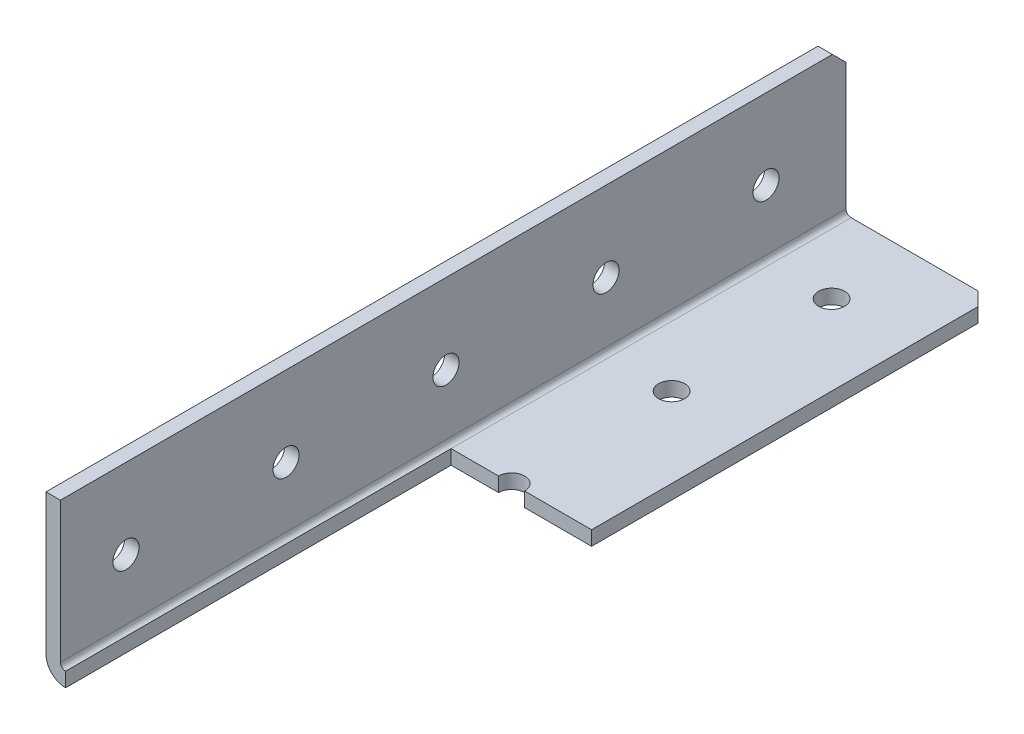
ISO-10303-21;
HEADER;
FILE_DESCRIPTION(('STEP AP214'),'2;1');
FILE_NAME('part.step','',(''),(''),'','','');
FILE_SCHEMA(('AUTOMOTIVE_DESIGN { 1 0 10303 214 1 1 1 1 }'));
ENDSEC;
DATA;
#1=APPLICATION_CONTEXT('core data for automotive mechanical design processes');
#2=APPLICATION_PROTOCOL_DEFINITION('international standard','automotive_design',2000,#1);
#3=PRODUCT_CONTEXT('',#1,'mechanical');
#4=PRODUCT('Part','Part','',(#3));
#5=PRODUCT_RELATED_PRODUCT_CATEGORY('part','',(#4));
#6=PRODUCT_DEFINITION_FORMATION('','',#4);
#7=PRODUCT_DEFINITION_CONTEXT('part definition',#1,'design');
#8=PRODUCT_DEFINITION('design','',#6,#7);
#9=PRODUCT_DEFINITION_SHAPE('','',#8);
#10=(LENGTH_UNIT() NAMED_UNIT(*) SI_UNIT(.MILLI.,.METRE.));
#11=(NAMED_UNIT(*) PLANE_ANGLE_UNIT() SI_UNIT($,.RADIAN.));
#12=(NAMED_UNIT(*) SI_UNIT($,.STERADIAN.) SOLID_ANGLE_UNIT());
#13=UNCERTAINTY_MEASURE_WITH_UNIT(LENGTH_MEASURE(1.E-05),#10,'distance_accuracy_value','');
#14=(GEOMETRIC_REPRESENTATION_CONTEXT(3) GLOBAL_UNCERTAINTY_ASSIGNED_CONTEXT((#13)) GLOBAL_UNIT_ASSIGNED_CONTEXT((#10,
#11,#12)) REPRESENTATION_CONTEXT('',''));
#15=CARTESIAN_POINT('',(0.,0.,0.));
#16=DIRECTION('',(0.,0.,1.));
#17=DIRECTION('',(1.,0.,0.));
#18=AXIS2_PLACEMENT_3D('',#15,#16,#17);
#19=CARTESIAN_POINT('',(25.4,0.,-749.3));
#20=DIRECTION('',(0.,-1.,0.));
#21=DIRECTION('',(0.,0.,-1.));
#22=AXIS2_PLACEMENT_3D('',#19,#20,#21);
#23=PLANE('',#22);
#24=DIRECTION('',(1.,0.,0.));
#25=VECTOR('',#24,1.);
#26=CARTESIAN_POINT('',(25.4,0.,-685.8));
#27=LINE('',#26,#25);
#28=CARTESIAN_POINT('',(3.0988,0.,-685.8));
#29=VERTEX_POINT('',#28);
#30=CARTESIAN_POINT('',(10.6299000000001,0.,-685.8));
#31=VERTEX_POINT('',#30);
#32=EDGE_CURVE('E221',#29,#31,#27,.T.);
#33=ORIENTED_EDGE('',*,*,#32,.F.);
#34=DIRECTION('',(0.,0.,1.));
#35=VECTOR('',#34,1.);
#36=CARTESIAN_POINT('',(3.0988,0.,-749.3));
#37=LINE('',#36,#35);
#38=CARTESIAN_POINT('',(3.0988,0.,-749.3));
#39=VERTEX_POINT('',#38);
#40=EDGE_CURVE('E203',#29,#39,#37,.F.);
#41=ORIENTED_EDGE('',*,*,#40,.T.);
#42=DIRECTION('',(-1.,0.,0.));
#43=VECTOR('',#42,1.);
#44=CARTESIAN_POINT('',(25.4,0.,-749.3));
#45=LINE('',#44,#43);
#46=CARTESIAN_POINT('',(23.2409999999998,0.,-749.3));
#47=VERTEX_POINT('',#46);
#48=EDGE_CURVE('E163',#47,#39,#45,.T.);
#49=ORIENTED_EDGE('',*,*,#48,.F.);
#50=DIRECTION('',(0.707106781186584,0.,0.707106781186511));
#51=VECTOR('',#50,1.);
#52=CARTESIAN_POINT('',(24.3205,0.,-748.2205));
#53=LINE('',#52,#51);
#54=CARTESIAN_POINT('',(25.4,0.,-747.141));
#55=VERTEX_POINT('',#54);
#56=EDGE_CURVE('E181',#47,#55,#53,.T.);
#57=ORIENTED_EDGE('',*,*,#56,.T.);
#58=DIRECTION('',(0.,0.,1.));
#59=VECTOR('',#58,1.);
#60=CARTESIAN_POINT('',(25.4,0.,-749.3));
#61=LINE('',#60,#59);
#62=CARTESIAN_POINT('',(25.4,0.,-685.8));
#63=VERTEX_POINT('',#62);
#64=EDGE_CURVE('E161',#55,#63,#61,.T.);
#65=ORIENTED_EDGE('',*,*,#64,.T.);
#66=CARTESIAN_POINT('',(14.7701,0.,-685.8));
#67=VERTEX_POINT('',#66);
#68=EDGE_CURVE('E131',#67,#63,#27,.T.);
#69=ORIENTED_EDGE('',*,*,#68,.F.);
#70=CARTESIAN_POINT('',(12.7,0.,-685.8));
#71=DIRECTION('',(0.,-1.,0.));
#72=DIRECTION('',(0.,0.,-1.));
#73=AXIS2_PLACEMENT_3D('',#70,#71,#72);
#74=CIRCLE('',#73,2.07009999999995);
#75=EDGE_CURVE('E231',#31,#67,#74,.T.);
#76=ORIENTED_EDGE('',*,*,#75,.F.);
#77=EDGE_LOOP('',(#33,#41,#49,#57,#65,#69,#76));
#78=FACE_BOUND('',#77,.T.);
#79=CARTESIAN_POINT('',(12.7,0.,-736.6));
#80=DIRECTION('',(0.,-1.,0.));
#81=DIRECTION('',(0.,0.,-1.));
#82=AXIS2_PLACEMENT_3D('',#79,#80,#81);
#83=CIRCLE('',#82,2.07009999999995);
#84=CARTESIAN_POINT('',(12.7,0.,-738.6701));
#85=VERTEX_POINT('',#84);
#86=EDGE_CURVE('E175',#85,#85,#83,.T.);
#87=ORIENTED_EDGE('',*,*,#86,.F.);
#88=EDGE_LOOP('',(#87));
#89=FACE_BOUND('',#88,.T.);
#90=CARTESIAN_POINT('',(12.7,0.,-711.2));
#91=DIRECTION('',(0.,-1.,0.));
#92=DIRECTION('',(0.,0.,-1.));
#93=AXIS2_PLACEMENT_3D('',#90,#91,#92);
#94=CIRCLE('',#93,2.07009999999995);
#95=CARTESIAN_POINT('',(12.7,0.,-713.2701));
#96=VERTEX_POINT('',#95);
#97=EDGE_CURVE('E174',#96,#96,#94,.T.);
#98=ORIENTED_EDGE('',*,*,#97,.F.);
#99=EDGE_LOOP('',(#98));
#100=FACE_BOUND('',#99,.T.);
#101=ADVANCED_FACE('F34',(#78,#89,#100),#23,.T.);
#102=CARTESIAN_POINT('',(25.4,25.4,-749.3));
#103=DIRECTION('',(0.,0.,-1.));
#104=DIRECTION('',(-1.,0.,0.));
#105=AXIS2_PLACEMENT_3D('',#102,#103,#104);
#106=PLANE('',#105);
#107=ORIENTED_EDGE('',*,*,#48,.T.);
#108=CARTESIAN_POINT('',(3.0988,3.0988,-749.3));
#109=DIRECTION('',(0.,0.,-1.));
#110=DIRECTION('',(-1.,0.,0.));
#111=AXIS2_PLACEMENT_3D('',#108,#109,#110);
#112=CIRCLE('',#111,3.0988);
#113=CARTESIAN_POINT('',(0.,3.0988,-749.3));
#114=VERTEX_POINT('',#113);
#115=EDGE_CURVE('E206',#39,#114,#112,.T.);
#116=ORIENTED_EDGE('',*,*,#115,.T.);
#117=DIRECTION('',(0.,-1.,0.));
#118=VECTOR('',#117,1.);
#119=CARTESIAN_POINT('',(0.,25.4,-749.3));
#120=LINE('',#119,#118);
#121=CARTESIAN_POINT('',(0.,23.241,-749.3));
#122=VERTEX_POINT('',#121);
#123=EDGE_CURVE('E164',#122,#114,#120,.T.);
#124=ORIENTED_EDGE('',*,*,#123,.F.);
#125=DIRECTION('',(1.,0.,0.));
#126=VECTOR('',#125,1.);
#127=CARTESIAN_POINT('',(25.4,23.241,-749.3));
#128=LINE('',#127,#126);
#129=CARTESIAN_POINT('',(2.286,23.241,-749.3));
#130=VERTEX_POINT('',#129);
#131=EDGE_CURVE('E170',#122,#130,#128,.T.);
#132=ORIENTED_EDGE('',*,*,#131,.T.);
#133=DIRECTION('',(0.,1.,0.));
#134=VECTOR('',#133,1.);
#135=CARTESIAN_POINT('',(2.286,2.286,-749.3));
#136=LINE('',#135,#134);
#137=CARTESIAN_POINT('',(2.286,3.0988,-749.3));
#138=VERTEX_POINT('',#137);
#139=EDGE_CURVE('E154',#138,#130,#136,.T.);
#140=ORIENTED_EDGE('',*,*,#139,.F.);
#141=CARTESIAN_POINT('',(3.0988,3.0988,-749.3));
#142=DIRECTION('',(0.,0.,-1.));
#143=DIRECTION('',(-1.,0.,0.));
#144=AXIS2_PLACEMENT_3D('',#141,#142,#143);
#145=CIRCLE('',#144,0.8128);
#146=CARTESIAN_POINT('',(3.0988,2.286,-749.3));
#147=VERTEX_POINT('',#146);
#148=EDGE_CURVE('E198',#138,#147,#145,.F.);
#149=ORIENTED_EDGE('',*,*,#148,.T.);
#150=DIRECTION('',(-1.,0.,0.));
#151=VECTOR('',#150,1.);
#152=CARTESIAN_POINT('',(25.4,2.286,-749.3));
#153=LINE('',#152,#151);
#154=CARTESIAN_POINT('',(23.2409999999998,2.286,-749.3));
#155=VERTEX_POINT('',#154);
#156=EDGE_CURVE('E158',#155,#147,#153,.T.);
#157=ORIENTED_EDGE('',*,*,#156,.F.);
#158=DIRECTION('',(0.,-1.,0.));
#159=VECTOR('',#158,1.);
#160=CARTESIAN_POINT('',(23.2409999999998,0.,-749.3));
#161=LINE('',#160,#159);
#162=EDGE_CURVE('E178',#155,#47,#161,.T.);
#163=ORIENTED_EDGE('',*,*,#162,.T.);
#164=EDGE_LOOP('',(#107,#116,#124,#132,#140,#149,#157,#163));
#165=FACE_BOUND('',#164,.T.);
#166=ADVANCED_FACE('F310',(#165),#106,.T.);
#167=CARTESIAN_POINT('',(25.4,25.4,749.3));
#168=DIRECTION('',(0.,1.,0.));
#169=DIRECTION('',(0.,0.,1.));
#170=AXIS2_PLACEMENT_3D('',#167,#168,#169);
#171=PLANE('',#170);
#172=DIRECTION('',(-1.,0.,0.));
#173=VECTOR('',#172,1.);
#174=CARTESIAN_POINT('',(25.4,25.4,-624.586));
#175=LINE('',#174,#173);
#176=CARTESIAN_POINT('',(2.286,25.4,-624.586));
#177=VERTEX_POINT('',#176);
#178=CARTESIAN_POINT('',(0.,25.4000000000002,-624.586));
#179=VERTEX_POINT('',#178);
#180=EDGE_CURVE('E236',#177,#179,#175,.T.);
#181=ORIENTED_EDGE('',*,*,#180,.F.);
#182=DIRECTION('',(0.,0.,-1.));
#183=VECTOR('',#182,1.);
#184=CARTESIAN_POINT('',(2.286,25.4,749.3));
#185=LINE('',#184,#183);
#186=CARTESIAN_POINT('',(2.286,25.4,-747.141));
#187=VERTEX_POINT('',#186);
#188=EDGE_CURVE('E153',#177,#187,#185,.T.);
#189=ORIENTED_EDGE('',*,*,#188,.T.);
#190=DIRECTION('',(-1.,0.,0.));
#191=VECTOR('',#190,1.);
#192=CARTESIAN_POINT('',(25.4,25.4,-747.141));
#193=LINE('',#192,#191);
#194=CARTESIAN_POINT('',(0.,25.4000000000002,-747.140999999999));
#195=VERTEX_POINT('',#194);
#196=EDGE_CURVE('E186',#187,#195,#193,.T.);
#197=ORIENTED_EDGE('',*,*,#196,.T.);
#198=DIRECTION('',(0.,0.,-1.));
#199=VECTOR('',#198,1.);
#200=CARTESIAN_POINT('',(0.,25.4,749.3));
#201=LINE('',#200,#199);
#202=EDGE_CURVE('E156',#179,#195,#201,.T.);
#203=ORIENTED_EDGE('',*,*,#202,.F.);
#204=EDGE_LOOP('',(#181,#189,#197,#203));
#205=FACE_BOUND('',#204,.T.);
#206=ADVANCED_FACE('F303',(#205),#171,.T.);
#207=CARTESIAN_POINT('',(25.4,0.,0.));
#208=DIRECTION('',(-1.,0.,0.));
#209=DIRECTION('',(0.,0.,1.));
#210=AXIS2_PLACEMENT_3D('',#207,#208,#209);
#211=PLANE('',#210);
#212=DIRECTION('',(0.,0.,-1.));
#213=VECTOR('',#212,1.);
#214=CARTESIAN_POINT('',(25.4,2.286,749.3));
#215=LINE('',#214,#213);
#216=CARTESIAN_POINT('',(25.4,2.286,-685.8));
#217=VERTEX_POINT('',#216);
#218=CARTESIAN_POINT('',(25.4000000000001,2.286,-747.141));
#219=VERTEX_POINT('',#218);
#220=EDGE_CURVE('E142',#217,#219,#215,.T.);
#221=ORIENTED_EDGE('',*,*,#220,.F.);
#222=DIRECTION('',(0.,1.,0.));
#223=VECTOR('',#222,1.);
#224=CARTESIAN_POINT('',(25.4,-0.254,-685.8));
#225=LINE('',#224,#223);
#226=EDGE_CURVE('E128',#63,#217,#225,.T.);
#227=ORIENTED_EDGE('',*,*,#226,.F.);
#228=ORIENTED_EDGE('',*,*,#64,.F.);
#229=DIRECTION('',(0.,1.,0.));
#230=VECTOR('',#229,1.);
#231=CARTESIAN_POINT('',(25.4,2.286,-747.141));
#232=LINE('',#231,#230);
#233=EDGE_CURVE('E151',#55,#219,#232,.T.);
#234=ORIENTED_EDGE('',*,*,#233,.T.);
#235=EDGE_LOOP('',(#221,#227,#228,#234));
#236=FACE_BOUND('',#235,.T.);
#237=ADVANCED_FACE('F149',(#236),#211,.F.);
#238=CARTESIAN_POINT('',(0.,0.,0.));
#239=DIRECTION('',(-1.,0.,0.));
#240=DIRECTION('',(0.,0.,1.));
#241=AXIS2_PLACEMENT_3D('',#238,#239,#240);
#242=PLANE('',#241);
#243=DIRECTION('',(0.,-1.,0.));
#244=VECTOR('',#243,1.);
#245=CARTESIAN_POINT('',(0.,0.,-624.586));
#246=LINE('',#245,#244);
#247=CARTESIAN_POINT('',(0.,3.0988,-624.586));
#248=VERTEX_POINT('',#247);
#249=EDGE_CURVE('E57',#179,#248,#246,.T.);
#250=ORIENTED_EDGE('',*,*,#249,.F.);
#251=ORIENTED_EDGE('',*,*,#202,.T.);
#252=DIRECTION('',(0.,0.707106781186511,0.707106781186584));
#253=VECTOR('',#252,1.);
#254=CARTESIAN_POINT('',(0.,386.270500000001,-386.270499999961));
#255=LINE('',#254,#253);
#256=EDGE_CURVE('E189',#195,#122,#255,.F.);
#257=ORIENTED_EDGE('',*,*,#256,.T.);
#258=ORIENTED_EDGE('',*,*,#123,.T.);
#259=DIRECTION('',(0.,0.,1.));
#260=VECTOR('',#259,1.);
#261=CARTESIAN_POINT('',(0.,3.0988,0.));
#262=LINE('',#261,#260);
#263=EDGE_CURVE('E200',#114,#248,#262,.T.);
#264=ORIENTED_EDGE('',*,*,#263,.T.);
#265=EDGE_LOOP('',(#250,#251,#257,#258,#264));
#266=FACE_BOUND('',#265,.T.);
#267=CARTESIAN_POINT('',(0.,12.7,-635.));
#268=DIRECTION('',(-1.,0.,0.));
#269=DIRECTION('',(0.,0.,1.));
#270=AXIS2_PLACEMENT_3D('',#267,#268,#269);
#271=CIRCLE('',#270,2.07009999999995);
#272=CARTESIAN_POINT('',(0.,12.7,-632.9299));
#273=VERTEX_POINT('',#272);
#274=EDGE_CURVE('E245',#273,#273,#271,.T.);
#275=ORIENTED_EDGE('',*,*,#274,.F.);
#276=EDGE_LOOP('',(#275));
#277=FACE_BOUND('',#276,.T.);
#278=CARTESIAN_POINT('',(0.,12.7,-660.4));
#279=DIRECTION('',(-1.,0.,0.));
#280=DIRECTION('',(0.,0.,1.));
#281=AXIS2_PLACEMENT_3D('',#278,#279,#280);
#282=CIRCLE('',#281,2.07009999999995);
#283=CARTESIAN_POINT('',(0.,12.7,-658.3299));
#284=VERTEX_POINT('',#283);
#285=EDGE_CURVE('E251',#284,#284,#282,.T.);
#286=ORIENTED_EDGE('',*,*,#285,.F.);
#287=EDGE_LOOP('',(#286));
#288=FACE_BOUND('',#287,.T.);
#289=CARTESIAN_POINT('',(0.,12.7,-685.8));
#290=DIRECTION('',(-1.,0.,0.));
#291=DIRECTION('',(0.,0.,1.));
#292=AXIS2_PLACEMENT_3D('',#289,#290,#291);
#293=CIRCLE('',#292,2.07009999999995);
#294=CARTESIAN_POINT('',(0.,12.7,-683.7299));
#295=VERTEX_POINT('',#294);
#296=EDGE_CURVE('E257',#295,#295,#293,.T.);
#297=ORIENTED_EDGE('',*,*,#296,.F.);
#298=EDGE_LOOP('',(#297));
#299=FACE_BOUND('',#298,.T.);
#300=CARTESIAN_POINT('',(0.,12.7,-711.2));
#301=DIRECTION('',(-1.,0.,0.));
#302=DIRECTION('',(0.,0.,1.));
#303=AXIS2_PLACEMENT_3D('',#300,#301,#302);
#304=CIRCLE('',#303,2.07009999999995);
#305=CARTESIAN_POINT('',(0.,12.7,-709.1299));
#306=VERTEX_POINT('',#305);
#307=EDGE_CURVE('E263',#306,#306,#304,.T.);
#308=ORIENTED_EDGE('',*,*,#307,.F.);
#309=EDGE_LOOP('',(#308));
#310=FACE_BOUND('',#309,.T.);
#311=CARTESIAN_POINT('',(0.,12.7,-736.6));
#312=DIRECTION('',(-1.,0.,0.));
#313=DIRECTION('',(0.,0.,1.));
#314=AXIS2_PLACEMENT_3D('',#311,#312,#313);
#315=CIRCLE('',#314,2.07009999999995);
#316=CARTESIAN_POINT('',(0.,12.7,-734.5299));
#317=VERTEX_POINT('',#316);
#318=EDGE_CURVE('E269',#317,#317,#315,.T.);
#319=ORIENTED_EDGE('',*,*,#318,.F.);
#320=EDGE_LOOP('',(#319));
#321=FACE_BOUND('',#320,.T.);
#322=ADVANCED_FACE('F306',(#266,#277,#288,#299,#310,#321),#242,.T.);
#323=CARTESIAN_POINT('',(2.286,2.286,749.3));
#324=DIRECTION('',(-1.,0.,0.));
#325=DIRECTION('',(0.,0.,1.));
#326=AXIS2_PLACEMENT_3D('',#323,#324,#325);
#327=PLANE('',#326);
#328=CARTESIAN_POINT('',(2.286,12.7,-635.));
#329=DIRECTION('',(-1.,0.,0.));
#330=DIRECTION('',(0.,0.,1.));
#331=AXIS2_PLACEMENT_3D('',#328,#329,#330);
#332=CIRCLE('',#331,2.07009999999995);
#333=CARTESIAN_POINT('',(2.286,12.7,-632.9299));
#334=VERTEX_POINT('',#333);
#335=EDGE_CURVE('E248',#334,#334,#332,.T.);
#336=ORIENTED_EDGE('',*,*,#335,.T.);
#337=EDGE_LOOP('',(#336));
#338=FACE_BOUND('',#337,.T.);
#339=CARTESIAN_POINT('',(2.286,12.7,-660.4));
#340=DIRECTION('',(-1.,0.,0.));
#341=DIRECTION('',(0.,0.,1.));
#342=AXIS2_PLACEMENT_3D('',#339,#340,#341);
#343=CIRCLE('',#342,2.07009999999995);
#344=CARTESIAN_POINT('',(2.286,12.7,-658.3299));
#345=VERTEX_POINT('',#344);
#346=EDGE_CURVE('E254',#345,#345,#343,.T.);
#347=ORIENTED_EDGE('',*,*,#346,.T.);
#348=EDGE_LOOP('',(#347));
#349=FACE_BOUND('',#348,.T.);
#350=CARTESIAN_POINT('',(2.286,12.7,-685.8));
#351=DIRECTION('',(-1.,0.,0.));
#352=DIRECTION('',(0.,0.,1.));
#353=AXIS2_PLACEMENT_3D('',#350,#351,#352);
#354=CIRCLE('',#353,2.07009999999995);
#355=CARTESIAN_POINT('',(2.286,12.7,-683.7299));
#356=VERTEX_POINT('',#355);
#357=EDGE_CURVE('E260',#356,#356,#354,.T.);
#358=ORIENTED_EDGE('',*,*,#357,.T.);
#359=EDGE_LOOP('',(#358));
#360=FACE_BOUND('',#359,.T.);
#361=CARTESIAN_POINT('',(2.286,12.7,-711.2));
#362=DIRECTION('',(-1.,0.,0.));
#363=DIRECTION('',(0.,0.,1.));
#364=AXIS2_PLACEMENT_3D('',#361,#362,#363);
#365=CIRCLE('',#364,2.07009999999995);
#366=CARTESIAN_POINT('',(2.286,12.7,-709.1299));
#367=VERTEX_POINT('',#366);
#368=EDGE_CURVE('E266',#367,#367,#365,.T.);
#369=ORIENTED_EDGE('',*,*,#368,.T.);
#370=EDGE_LOOP('',(#369));
#371=FACE_BOUND('',#370,.T.);
#372=CARTESIAN_POINT('',(2.286,12.7,-736.6));
#373=DIRECTION('',(-1.,0.,0.));
#374=DIRECTION('',(0.,0.,1.));
#375=AXIS2_PLACEMENT_3D('',#372,#373,#374);
#376=CIRCLE('',#375,2.07009999999995);
#377=CARTESIAN_POINT('',(2.286,12.7,-734.5299));
#378=VERTEX_POINT('',#377);
#379=EDGE_CURVE('E272',#378,#378,#376,.T.);
#380=ORIENTED_EDGE('',*,*,#379,.T.);
#381=EDGE_LOOP('',(#380));
#382=FACE_BOUND('',#381,.T.);
#383=ORIENTED_EDGE('',*,*,#188,.F.);
#384=DIRECTION('',(0.,-1.,0.));
#385=VECTOR('',#384,1.);
#386=CARTESIAN_POINT('',(2.286,2.286,-624.586));
#387=LINE('',#386,#385);
#388=CARTESIAN_POINT('',(2.286,3.0988,-624.586));
#389=VERTEX_POINT('',#388);
#390=EDGE_CURVE('E238',#177,#389,#387,.T.);
#391=ORIENTED_EDGE('',*,*,#390,.T.);
#392=DIRECTION('',(0.,0.,-1.));
#393=VECTOR('',#392,1.);
#394=CARTESIAN_POINT('',(2.286,3.0988,-749.3));
#395=LINE('',#394,#393);
#396=EDGE_CURVE('E194',#389,#138,#395,.T.);
#397=ORIENTED_EDGE('',*,*,#396,.T.);
#398=ORIENTED_EDGE('',*,*,#139,.T.);
#399=DIRECTION('',(0.,-0.707106781186511,-0.707106781186584));
#400=VECTOR('',#399,1.);
#401=CARTESIAN_POINT('',(2.286,25.4,-747.141));
#402=LINE('',#401,#400);
#403=EDGE_CURVE('E191',#130,#187,#402,.F.);
#404=ORIENTED_EDGE('',*,*,#403,.T.);
#405=EDGE_LOOP('',(#383,#391,#397,#398,#404));
#406=FACE_BOUND('',#405,.T.);
#407=ADVANCED_FACE('F299',(#338,#349,#360,#371,#382,#406),#327,.F.);
#408=CARTESIAN_POINT('',(25.4,2.286,749.3));
#409=DIRECTION('',(0.,-1.,0.));
#410=DIRECTION('',(0.,0.,-1.));
#411=AXIS2_PLACEMENT_3D('',#408,#409,#410);
#412=PLANE('',#411);
#413=CARTESIAN_POINT('',(12.7,2.286,-736.6));
#414=DIRECTION('',(0.,-1.,0.));
#415=DIRECTION('',(0.,0.,-1.));
#416=AXIS2_PLACEMENT_3D('',#413,#414,#415);
#417=CIRCLE('',#416,2.07009999999995);
#418=CARTESIAN_POINT('',(12.7,2.286,-738.6701));
#419=VERTEX_POINT('',#418);
#420=EDGE_CURVE('E171',#419,#419,#417,.T.);
#421=ORIENTED_EDGE('',*,*,#420,.T.);
#422=EDGE_LOOP('',(#421));
#423=FACE_BOUND('',#422,.T.);
#424=CARTESIAN_POINT('',(12.7,2.286,-711.2));
#425=DIRECTION('',(0.,-1.,0.));
#426=DIRECTION('',(0.,0.,-1.));
#427=AXIS2_PLACEMENT_3D('',#424,#425,#426);
#428=CIRCLE('',#427,2.07009999999995);
#429=CARTESIAN_POINT('',(12.7,2.286,-713.2701));
#430=VERTEX_POINT('',#429);
#431=EDGE_CURVE('E279',#430,#430,#428,.T.);
#432=ORIENTED_EDGE('',*,*,#431,.T.);
#433=EDGE_LOOP('',(#432));
#434=FACE_BOUND('',#433,.T.);
#435=DIRECTION('',(0.,0.,-1.));
#436=VECTOR('',#435,1.);
#437=CARTESIAN_POINT('',(3.0988,2.286,749.3));
#438=LINE('',#437,#436);
#439=CARTESIAN_POINT('',(3.0988,2.286,-685.8));
#440=VERTEX_POINT('',#439);
#441=EDGE_CURVE('E196',#147,#440,#438,.F.);
#442=ORIENTED_EDGE('',*,*,#441,.T.);
#443=DIRECTION('',(-1.,0.,0.));
#444=VECTOR('',#443,1.);
#445=CARTESIAN_POINT('',(3.0988,2.286,-685.8));
#446=LINE('',#445,#444);
#447=CARTESIAN_POINT('',(10.6299000000001,2.286,-685.8));
#448=VERTEX_POINT('',#447);
#449=EDGE_CURVE('E147',#448,#440,#446,.T.);
#450=ORIENTED_EDGE('',*,*,#449,.F.);
#451=CARTESIAN_POINT('',(12.7,2.286,-685.8));
#452=DIRECTION('',(0.,-1.,0.));
#453=DIRECTION('',(0.,0.,-1.));
#454=AXIS2_PLACEMENT_3D('',#451,#452,#453);
#455=CIRCLE('',#454,2.07009999999995);
#456=CARTESIAN_POINT('',(14.7701,2.286,-685.8));
#457=VERTEX_POINT('',#456);
#458=EDGE_CURVE('E146',#448,#457,#455,.T.);
#459=ORIENTED_EDGE('',*,*,#458,.T.);
#460=EDGE_CURVE('E49',#217,#457,#446,.T.);
#461=ORIENTED_EDGE('',*,*,#460,.F.);
#462=ORIENTED_EDGE('',*,*,#220,.T.);
#463=DIRECTION('',(-0.707106781186584,0.,-0.707106781186511));
#464=VECTOR('',#463,1.);
#465=CARTESIAN_POINT('',(23.2409999999998,2.286,-749.3));
#466=LINE('',#465,#464);
#467=EDGE_CURVE('E184',#219,#155,#466,.T.);
#468=ORIENTED_EDGE('',*,*,#467,.T.);
#469=ORIENTED_EDGE('',*,*,#156,.T.);
#470=EDGE_LOOP('',(#442,#450,#459,#461,#462,#468,#469));
#471=FACE_BOUND('',#470,.T.);
#472=ADVANCED_FACE('F141',(#423,#434,#471),#412,.F.);
#473=CARTESIAN_POINT('',(12.7,0.,-685.8));
#474=DIRECTION('',(0.,-1.,0.));
#475=DIRECTION('',(0.,0.,-1.));
#476=AXIS2_PLACEMENT_3D('',#473,#474,#475);
#477=CYLINDRICAL_SURFACE('',#476,2.07009999999995);
#478=ORIENTED_EDGE('',*,*,#75,.T.);
#479=DIRECTION('',(0.,-1.,0.));
#480=VECTOR('',#479,1.);
#481=CARTESIAN_POINT('',(14.7701,0.,-685.8));
#482=LINE('',#481,#480);
#483=EDGE_CURVE('E232',#67,#457,#482,.F.);
#484=ORIENTED_EDGE('',*,*,#483,.T.);
#485=ORIENTED_EDGE('',*,*,#458,.F.);
#486=DIRECTION('',(0.,-1.,0.));
#487=VECTOR('',#486,1.);
#488=CARTESIAN_POINT('',(10.6299000000001,0.,-685.8));
#489=LINE('',#488,#487);
#490=EDGE_CURVE('E224',#448,#31,#489,.T.);
#491=ORIENTED_EDGE('',*,*,#490,.T.);
#492=EDGE_LOOP('',(#478,#484,#485,#491));
#493=FACE_BOUND('',#492,.T.);
#494=ADVANCED_FACE('F343',(#493),#477,.F.);
#495=CARTESIAN_POINT('',(12.7,0.,-711.2));
#496=DIRECTION('',(0.,-1.,0.));
#497=DIRECTION('',(0.,0.,-1.));
#498=AXIS2_PLACEMENT_3D('',#495,#496,#497);
#499=CYLINDRICAL_SURFACE('',#498,2.07009999999995);
#500=ORIENTED_EDGE('',*,*,#97,.T.);
#501=EDGE_LOOP('',(#500));
#502=FACE_BOUND('',#501,.T.);
#503=ORIENTED_EDGE('',*,*,#431,.F.);
#504=EDGE_LOOP('',(#503));
#505=FACE_BOUND('',#504,.T.);
#506=ADVANCED_FACE('F350',(#502,#505),#499,.F.);
#507=CARTESIAN_POINT('',(12.7,0.,-736.6));
#508=DIRECTION('',(0.,-1.,0.));
#509=DIRECTION('',(0.,0.,-1.));
#510=AXIS2_PLACEMENT_3D('',#507,#508,#509);
#511=CYLINDRICAL_SURFACE('',#510,2.07009999999995);
#512=ORIENTED_EDGE('',*,*,#86,.T.);
#513=EDGE_LOOP('',(#512));
#514=FACE_BOUND('',#513,.T.);
#515=ORIENTED_EDGE('',*,*,#420,.F.);
#516=EDGE_LOOP('',(#515));
#517=FACE_BOUND('',#516,.T.);
#518=ADVANCED_FACE('F354',(#514,#517),#511,.F.);
#519=CARTESIAN_POINT('',(0.,12.7,-736.6));
#520=DIRECTION('',(-1.,0.,0.));
#521=DIRECTION('',(0.,0.,1.));
#522=AXIS2_PLACEMENT_3D('',#519,#520,#521);
#523=CYLINDRICAL_SURFACE('',#522,2.07009999999995);
#524=ORIENTED_EDGE('',*,*,#318,.T.);
#525=EDGE_LOOP('',(#524));
#526=FACE_BOUND('',#525,.T.);
#527=ORIENTED_EDGE('',*,*,#379,.F.);
#528=EDGE_LOOP('',(#527));
#529=FACE_BOUND('',#528,.T.);
#530=ADVANCED_FACE('F358',(#526,#529),#523,.F.);
#531=CARTESIAN_POINT('',(0.,12.7,-711.2));
#532=DIRECTION('',(-1.,0.,0.));
#533=DIRECTION('',(0.,0.,1.));
#534=AXIS2_PLACEMENT_3D('',#531,#532,#533);
#535=CYLINDRICAL_SURFACE('',#534,2.07009999999995);
#536=ORIENTED_EDGE('',*,*,#307,.T.);
#537=EDGE_LOOP('',(#536));
#538=FACE_BOUND('',#537,.T.);
#539=ORIENTED_EDGE('',*,*,#368,.F.);
#540=EDGE_LOOP('',(#539));
#541=FACE_BOUND('',#540,.T.);
#542=ADVANCED_FACE('F362',(#538,#541),#535,.F.);
#543=CARTESIAN_POINT('',(0.,12.7,-685.8));
#544=DIRECTION('',(-1.,0.,0.));
#545=DIRECTION('',(0.,0.,1.));
#546=AXIS2_PLACEMENT_3D('',#543,#544,#545);
#547=CYLINDRICAL_SURFACE('',#546,2.07009999999995);
#548=ORIENTED_EDGE('',*,*,#296,.T.);
#549=EDGE_LOOP('',(#548));
#550=FACE_BOUND('',#549,.T.);
#551=ORIENTED_EDGE('',*,*,#357,.F.);
#552=EDGE_LOOP('',(#551));
#553=FACE_BOUND('',#552,.T.);
#554=ADVANCED_FACE('F366',(#550,#553),#547,.F.);
#555=CARTESIAN_POINT('',(0.,12.7,-660.4));
#556=DIRECTION('',(-1.,0.,0.));
#557=DIRECTION('',(0.,0.,1.));
#558=AXIS2_PLACEMENT_3D('',#555,#556,#557);
#559=CYLINDRICAL_SURFACE('',#558,2.07009999999995);
#560=ORIENTED_EDGE('',*,*,#285,.T.);
#561=EDGE_LOOP('',(#560));
#562=FACE_BOUND('',#561,.T.);
#563=ORIENTED_EDGE('',*,*,#346,.F.);
#564=EDGE_LOOP('',(#563));
#565=FACE_BOUND('',#564,.T.);
#566=ADVANCED_FACE('F324',(#562,#565),#559,.F.);
#567=CARTESIAN_POINT('',(0.,12.7,-635.));
#568=DIRECTION('',(-1.,0.,0.));
#569=DIRECTION('',(0.,0.,1.));
#570=AXIS2_PLACEMENT_3D('',#567,#568,#569);
#571=CYLINDRICAL_SURFACE('',#570,2.07009999999995);
#572=ORIENTED_EDGE('',*,*,#274,.T.);
#573=EDGE_LOOP('',(#572));
#574=FACE_BOUND('',#573,.T.);
#575=ORIENTED_EDGE('',*,*,#335,.F.);
#576=EDGE_LOOP('',(#575));
#577=FACE_BOUND('',#576,.T.);
#578=ADVANCED_FACE('F316',(#574,#577),#571,.F.);
#579=CARTESIAN_POINT('',(23.2409999999998,25.4,-749.3));
#580=DIRECTION('',(0.707106781186511,0.,-0.707106781186584));
#581=DIRECTION('',(0.,1.,0.));
#582=AXIS2_PLACEMENT_3D('',#579,#580,#581);
#583=PLANE('',#582);
#584=ORIENTED_EDGE('',*,*,#467,.F.);
#585=ORIENTED_EDGE('',*,*,#233,.F.);
#586=ORIENTED_EDGE('',*,*,#56,.F.);
#587=ORIENTED_EDGE('',*,*,#162,.F.);
#588=EDGE_LOOP('',(#584,#585,#586,#587));
#589=FACE_BOUND('',#588,.T.);
#590=ADVANCED_FACE('F313',(#589),#583,.T.);
#591=CARTESIAN_POINT('',(25.4,25.4,-747.141));
#592=DIRECTION('',(0.,-0.707106781186584,0.707106781186511));
#593=DIRECTION('',(-1.,0.,0.));
#594=AXIS2_PLACEMENT_3D('',#591,#592,#593);
#595=PLANE('',#594);
#596=ORIENTED_EDGE('',*,*,#403,.F.);
#597=ORIENTED_EDGE('',*,*,#131,.F.);
#598=ORIENTED_EDGE('',*,*,#256,.F.);
#599=ORIENTED_EDGE('',*,*,#196,.F.);
#600=EDGE_LOOP('',(#596,#597,#598,#599));
#601=FACE_BOUND('',#600,.T.);
#602=ADVANCED_FACE('F315',(#601),#595,.F.);
#603=CARTESIAN_POINT('',(3.0988,3.0988,749.3));
#604=DIRECTION('',(0.,0.,1.));
#605=DIRECTION('',(1.,0.,0.));
#606=AXIS2_PLACEMENT_3D('',#603,#604,#605);
#607=CYLINDRICAL_SURFACE('',#606,0.8128);
#608=ORIENTED_EDGE('',*,*,#396,.F.);
#609=CARTESIAN_POINT('',(3.0988,3.0988,-624.586));
#610=DIRECTION('',(0.,0.,-1.));
#611=DIRECTION('',(-1.,0.,0.));
#612=AXIS2_PLACEMENT_3D('',#609,#610,#611);
#613=CIRCLE('',#612,0.8128);
#614=CARTESIAN_POINT('',(3.0988,2.286,-624.586));
#615=VERTEX_POINT('',#614);
#616=EDGE_CURVE('E243',#389,#615,#613,.F.);
#617=ORIENTED_EDGE('',*,*,#616,.T.);
#618=DIRECTION('',(0.,0.,1.));
#619=VECTOR('',#618,1.);
#620=CARTESIAN_POINT('',(3.0988,2.286,-685.8));
#621=LINE('',#620,#619);
#622=EDGE_CURVE('E294',#440,#615,#621,.T.);
#623=ORIENTED_EDGE('',*,*,#622,.F.);
#624=ORIENTED_EDGE('',*,*,#441,.F.);
#625=ORIENTED_EDGE('',*,*,#148,.F.);
#626=EDGE_LOOP('',(#608,#617,#623,#624,#625));
#627=FACE_BOUND('',#626,.T.);
#628=ADVANCED_FACE('F292',(#627),#607,.F.);
#629=CARTESIAN_POINT('',(3.0988,3.0988,0.));
#630=DIRECTION('',(0.,0.,1.));
#631=DIRECTION('',(1.,0.,0.));
#632=AXIS2_PLACEMENT_3D('',#629,#630,#631);
#633=CYLINDRICAL_SURFACE('',#632,3.0988);
#634=CARTESIAN_POINT('',(3.0988,3.0988,-624.586));
#635=DIRECTION('',(0.,0.,-1.));
#636=DIRECTION('',(-1.,0.,0.));
#637=AXIS2_PLACEMENT_3D('',#634,#635,#636);
#638=CIRCLE('',#637,3.0988);
#639=CARTESIAN_POINT('',(3.0988,0.,-624.586));
#640=VERTEX_POINT('',#639);
#641=EDGE_CURVE('E42',#248,#640,#638,.F.);
#642=ORIENTED_EDGE('',*,*,#641,.F.);
#643=ORIENTED_EDGE('',*,*,#263,.F.);
#644=ORIENTED_EDGE('',*,*,#115,.F.);
#645=ORIENTED_EDGE('',*,*,#40,.F.);
#646=EDGE_CURVE('E204',#640,#29,#37,.F.);
#647=ORIENTED_EDGE('',*,*,#646,.F.);
#648=EDGE_LOOP('',(#642,#643,#644,#645,#647));
#649=FACE_BOUND('',#648,.T.);
#650=ADVANCED_FACE('F36',(#649),#633,.T.);
#651=CARTESIAN_POINT('',(0.,0.,-624.586));
#652=DIRECTION('',(0.,0.,-1.));
#653=DIRECTION('',(-1.,0.,0.));
#654=AXIS2_PLACEMENT_3D('',#651,#652,#653);
#655=PLANE('',#654);
#656=ORIENTED_EDGE('',*,*,#641,.T.);
#657=DIRECTION('',(0.,1.,0.));
#658=VECTOR('',#657,1.);
#659=CARTESIAN_POINT('',(3.0988,0.,-624.586));
#660=LINE('',#659,#658);
#661=EDGE_CURVE('E11',#640,#615,#660,.T.);
#662=ORIENTED_EDGE('',*,*,#661,.T.);
#663=ORIENTED_EDGE('',*,*,#616,.F.);
#664=ORIENTED_EDGE('',*,*,#390,.F.);
#665=ORIENTED_EDGE('',*,*,#180,.T.);
#666=ORIENTED_EDGE('',*,*,#249,.T.);
#667=EDGE_LOOP('',(#656,#662,#663,#664,#665,#666));
#668=FACE_BOUND('',#667,.T.);
#669=ADVANCED_FACE('F208',(#668),#655,.F.);
#670=CARTESIAN_POINT('',(3.0988,-0.254,-685.8));
#671=DIRECTION('',(-1.,0.,0.));
#672=DIRECTION('',(0.,0.,1.));
#673=AXIS2_PLACEMENT_3D('',#670,#671,#672);
#674=PLANE('',#673);
#675=ORIENTED_EDGE('',*,*,#646,.T.);
#676=DIRECTION('',(0.,1.,0.));
#677=VECTOR('',#676,1.);
#678=CARTESIAN_POINT('',(3.0988,-0.254,-685.8));
#679=LINE('',#678,#677);
#680=EDGE_CURVE('E136',#29,#440,#679,.T.);
#681=ORIENTED_EDGE('',*,*,#680,.T.);
#682=ORIENTED_EDGE('',*,*,#622,.T.);
#683=ORIENTED_EDGE('',*,*,#661,.F.);
#684=EDGE_LOOP('',(#675,#681,#682,#683));
#685=FACE_BOUND('',#684,.T.);
#686=ADVANCED_FACE('F216',(#685),#674,.F.);
#687=CARTESIAN_POINT('',(3.0988,-0.254,-685.8));
#688=DIRECTION('',(0.,0.,-1.));
#689=DIRECTION('',(-1.,0.,0.));
#690=AXIS2_PLACEMENT_3D('',#687,#688,#689);
#691=PLANE('',#690);
#692=ORIENTED_EDGE('',*,*,#32,.T.);
#693=ORIENTED_EDGE('',*,*,#490,.F.);
#694=ORIENTED_EDGE('',*,*,#449,.T.);
#695=ORIENTED_EDGE('',*,*,#680,.F.);
#696=EDGE_LOOP('',(#692,#693,#694,#695));
#697=FACE_BOUND('',#696,.T.);
#698=ADVANCED_FACE('F220',(#697),#691,.F.);
#699=ORIENTED_EDGE('',*,*,#68,.T.);
#700=ORIENTED_EDGE('',*,*,#226,.T.);
#701=ORIENTED_EDGE('',*,*,#460,.T.);
#702=ORIENTED_EDGE('',*,*,#483,.F.);
#703=EDGE_LOOP('',(#699,#700,#701,#702));
#704=FACE_BOUND('',#703,.T.);
#705=ADVANCED_FACE('F129',(#704),#691,.F.);
#706=CLOSED_SHELL('',(#101,#166,#206,#237,#322,#407,#472,#494,#506,#518,#530,#542,#554,#566,
#578,#590,#602,#628,#650,#669,#686,#698,#705));
#707=MANIFOLD_SOLID_BREP('B2',#706);
#708=ADVANCED_BREP_SHAPE_REPRESENTATION('',(#18,#707),#14);
#709=SHAPE_DEFINITION_REPRESENTATION(#9,#708);
ENDSEC;
END-ISO-10303-21;
